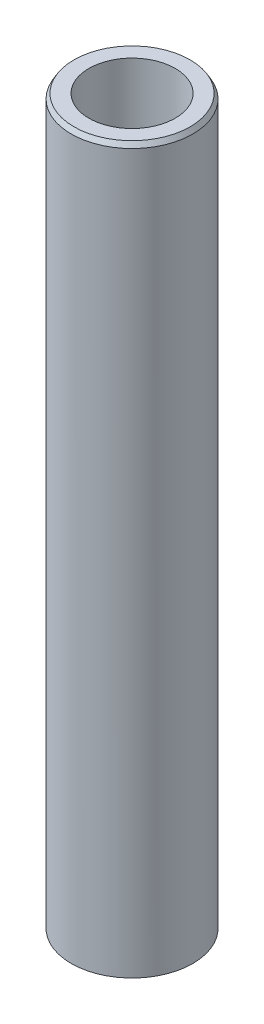
ISO-10303-21;
HEADER;
FILE_DESCRIPTION(('STEP AP214'),'2;1');
FILE_NAME('part.step','',(''),(''),'','','');
FILE_SCHEMA(('AUTOMOTIVE_DESIGN { 1 0 10303 214 1 1 1 1 }'));
ENDSEC;
DATA;
#1=APPLICATION_CONTEXT('core data for automotive mechanical design processes');
#2=APPLICATION_PROTOCOL_DEFINITION('international standard','automotive_design',2000,#1);
#3=PRODUCT_CONTEXT('',#1,'mechanical');
#4=PRODUCT('Part','Part','',(#3));
#5=PRODUCT_RELATED_PRODUCT_CATEGORY('part','',(#4));
#6=PRODUCT_DEFINITION_FORMATION('','',#4);
#7=PRODUCT_DEFINITION_CONTEXT('part definition',#1,'design');
#8=PRODUCT_DEFINITION('design','',#6,#7);
#9=PRODUCT_DEFINITION_SHAPE('','',#8);
#10=(LENGTH_UNIT() NAMED_UNIT(*) SI_UNIT(.MILLI.,.METRE.));
#11=(NAMED_UNIT(*) PLANE_ANGLE_UNIT() SI_UNIT($,.RADIAN.));
#12=(NAMED_UNIT(*) SI_UNIT($,.STERADIAN.) SOLID_ANGLE_UNIT());
#13=UNCERTAINTY_MEASURE_WITH_UNIT(LENGTH_MEASURE(1.E-05),#10,'distance_accuracy_value','');
#14=(GEOMETRIC_REPRESENTATION_CONTEXT(3) GLOBAL_UNCERTAINTY_ASSIGNED_CONTEXT((#13)) GLOBAL_UNIT_ASSIGNED_CONTEXT((#10,
#11,#12)) REPRESENTATION_CONTEXT('',''));
#15=CARTESIAN_POINT('',(0.,0.,0.));
#16=DIRECTION('',(0.,0.,1.));
#17=DIRECTION('',(1.,0.,0.));
#18=AXIS2_PLACEMENT_3D('',#15,#16,#17);
#19=CARTESIAN_POINT('',(0.,477.313091450033,0.));
#20=DIRECTION('',(0.,-1.,0.));
#21=DIRECTION('',(0.,0.,-1.));
#22=AXIS2_PLACEMENT_3D('',#19,#20,#21);
#23=CYLINDRICAL_SURFACE('',#22,40.);
#24=CARTESIAN_POINT('',(0.,474.139683479003,0.));
#25=DIRECTION('',(0.,1.,0.));
#26=DIRECTION('',(0.,0.,1.));
#27=AXIS2_PLACEMENT_3D('',#24,#25,#26);
#28=CIRCLE('',#27,40.);
#29=CARTESIAN_POINT('',(0.,474.139683479003,-40.));
#30=VERTEX_POINT('',#29);
#31=EDGE_CURVE('E50',#30,#30,#28,.F.);
#32=CARTESIAN_POINT('',(0.,1.83216794632313,0.));
#33=DIRECTION('',(0.,1.,0.));
#34=DIRECTION('',(0.,0.,1.));
#35=AXIS2_PLACEMENT_3D('',#32,#33,#34);
#36=CIRCLE('',#35,40.);
#37=CARTESIAN_POINT('',(0.,1.83216794632307,-40.));
#38=VERTEX_POINT('',#37);
#39=EDGE_CURVE('E51',#38,#38,#36,.T.);
#40=CARTESIAN_POINT('',(0.,474.139683479003,-40.));
#41=CARTESIAN_POINT('',(0.,469.219813525538,-40.));
#42=CARTESIAN_POINT('',(0.,464.299943572072,-40.));
#43=CARTESIAN_POINT('',(0.,454.460203665141,-40.));
#44=CARTESIAN_POINT('',(0.,449.540333711676,-40.));
#45=CARTESIAN_POINT('',(0.,439.700593804745,-40.));
#46=CARTESIAN_POINT('',(0.,434.78072385128,-40.));
#47=CARTESIAN_POINT('',(0.,424.940983944349,-40.));
#48=CARTESIAN_POINT('',(0.,420.021113990883,-40.));
#49=CARTESIAN_POINT('',(0.,410.181374083953,-40.));
#50=CARTESIAN_POINT('',(0.,405.261504130487,-40.));
#51=CARTESIAN_POINT('',(0.,395.421764223556,-40.));
#52=CARTESIAN_POINT('',(0.,390.501894270091,-40.));
#53=CARTESIAN_POINT('',(0.,380.66215436316,-40.));
#54=CARTESIAN_POINT('',(0.,375.742284409695,-40.));
#55=CARTESIAN_POINT('',(0.,365.902544502764,-40.));
#56=CARTESIAN_POINT('',(0.,360.982674549299,-40.));
#57=CARTESIAN_POINT('',(0.,351.142934642368,-40.));
#58=CARTESIAN_POINT('',(0.,346.223064688902,-40.));
#59=CARTESIAN_POINT('',(0.,336.383324781971,-40.));
#60=CARTESIAN_POINT('',(0.,331.463454828506,-40.));
#61=CARTESIAN_POINT('',(0.,321.623714921575,-40.));
#62=CARTESIAN_POINT('',(0.,316.70384496811,-40.));
#63=CARTESIAN_POINT('',(0.,306.864105061179,-40.));
#64=CARTESIAN_POINT('',(0.,301.944235107713,-40.));
#65=CARTESIAN_POINT('',(0.,292.104495200783,-40.));
#66=CARTESIAN_POINT('',(0.,287.184625247317,-40.));
#67=CARTESIAN_POINT('',(0.,277.344885340386,-40.));
#68=CARTESIAN_POINT('',(0.,272.425015386921,-40.));
#69=CARTESIAN_POINT('',(0.,262.58527547999,-40.));
#70=CARTESIAN_POINT('',(0.,257.665405526525,-40.));
#71=CARTESIAN_POINT('',(0.,247.825665619594,-40.));
#72=CARTESIAN_POINT('',(0.,242.905795666128,-40.));
#73=CARTESIAN_POINT('',(0.,233.066055759198,-40.));
#74=CARTESIAN_POINT('',(0.,228.146185805732,-40.));
#75=CARTESIAN_POINT('',(0.,218.306445898801,-40.));
#76=CARTESIAN_POINT('',(0.,213.386575945336,-40.));
#77=CARTESIAN_POINT('',(0.,203.546836038405,-40.));
#78=CARTESIAN_POINT('',(0.,198.62696608494,-40.));
#79=CARTESIAN_POINT('',(0.,188.787226178009,-40.));
#80=CARTESIAN_POINT('',(0.,183.867356224543,-40.));
#81=CARTESIAN_POINT('',(0.,174.027616317613,-40.));
#82=CARTESIAN_POINT('',(0.,169.107746364147,-40.));
#83=CARTESIAN_POINT('',(0.,159.268006457216,-40.));
#84=CARTESIAN_POINT('',(0.,154.348136503751,-40.));
#85=CARTESIAN_POINT('',(0.,144.50839659682,-40.));
#86=CARTESIAN_POINT('',(0.,139.588526643355,-40.));
#87=CARTESIAN_POINT('',(0.,129.748786736424,-40.));
#88=CARTESIAN_POINT('',(0.,124.828916782958,-40.));
#89=CARTESIAN_POINT('',(0.,114.989176876028,-40.));
#90=CARTESIAN_POINT('',(0.,110.069306922562,-40.));
#91=CARTESIAN_POINT('',(0.,100.229567015631,-40.));
#92=CARTESIAN_POINT('',(0.,95.3096970621661,-40.));
#93=CARTESIAN_POINT('',(0.,85.4699571552352,-40.));
#94=CARTESIAN_POINT('',(0.,80.5500872017698,-40.));
#95=CARTESIAN_POINT('',(0.,70.710347294839,-40.));
#96=CARTESIAN_POINT('',(0.,65.7904773413735,-40.));
#97=CARTESIAN_POINT('',(0.,55.9507374344427,-40.));
#98=CARTESIAN_POINT('',(0.,51.0308674809773,-40.));
#99=CARTESIAN_POINT('',(0.,41.1911275740464,-40.));
#100=CARTESIAN_POINT('',(0.,36.271257620581,-40.));
#101=CARTESIAN_POINT('',(0.,26.4315177136502,-40.));
#102=CARTESIAN_POINT('',(0.,21.5116477601848,-40.));
#103=CARTESIAN_POINT('',(0.,11.6719078532539,-40.));
#104=CARTESIAN_POINT('',(0.,6.75203789978848,-40.));
#105=CARTESIAN_POINT('',(0.,1.83216794632307,-40.));
#106=B_SPLINE_CURVE_WITH_KNOTS('',3,(#40,#41,#42,#43,#44,#45,#46,#47,#48,#49,#50,#51,#52,#53,
#54,#55,#56,#57,#58,#59,#60,#61,#62,#63,#64,#65,#66,#67,#68,#69,#70,#71,#72,#73,#74,#75,#76,#77,
#78,#79,#80,#81,#82,#83,#84,#85,#86,#87,#88,#89,#90,#91,#92,#93,#94,#95,#96,#97,#98,#99,#100,
#101,#102,#103,#104,#105),.UNSPECIFIED.,.F.,.F.,(4,2,2,2,2,2,2,2,2,2,2,2,2,2,2,2,2,2,2,2,2,2,2,
2,2,2,2,2,2,2,2,2,4),(0.,14.7596098603963,29.5192197207925,44.2788295811888,59.038439441585,
73.7980493019813,88.5576591623775,103.317269022774,118.07687888317,132.836488743566,
147.596098603963,162.355708464359,177.115318324755,191.874928185151,206.634538045547,
221.394147905944,236.15375776634,250.913367626736,265.672977487132,280.432587347529,
295.192197207925,309.951807068321,324.711416928718,339.471026789114,354.23063664951,
368.990246509906,383.749856370302,398.509466230699,413.269076091095,428.028685951491,
442.788295811888,457.547905672284,472.30751553268),.UNSPECIFIED.);
#107=EDGE_CURVE('BSEAM39',#30,#38,#106,.T.);
#108=ORIENTED_EDGE('',*,*,#31,.T.);
#109=ORIENTED_EDGE('',*,*,#39,.T.);
#110=ORIENTED_EDGE('',*,*,#107,.T.);
#111=ORIENTED_EDGE('',*,*,#107,.F.);
#112=EDGE_LOOP('',(#108,#110,#109,#111));
#113=FACE_BOUND('',#112,.T.);
#114=ADVANCED_FACE('F39',(#113),#23,.T.);
#115=CARTESIAN_POINT('',(0.,477.313091450033,0.));
#116=DIRECTION('',(0.,1.,0.));
#117=DIRECTION('',(0.,0.,1.));
#118=AXIS2_PLACEMENT_3D('',#115,#116,#117);
#119=PLANE('',#118);
#120=CARTESIAN_POINT('',(0.,477.313091450033,0.));
#121=DIRECTION('',(0.,1.,0.));
#122=DIRECTION('',(0.,0.,1.));
#123=AXIS2_PLACEMENT_3D('',#120,#121,#122);
#124=CIRCLE('',#123,38.1678320536773);
#125=CARTESIAN_POINT('',(0.,477.313091450033,38.1678320536773));
#126=VERTEX_POINT('',#125);
#127=EDGE_CURVE('E54',#126,#126,#124,.T.);
#128=ORIENTED_EDGE('',*,*,#127,.T.);
#129=EDGE_LOOP('',(#128));
#130=FACE_BOUND('',#129,.T.);
#131=CARTESIAN_POINT('',(0.,477.313091450033,0.));
#132=DIRECTION('',(0.,1.,0.));
#133=DIRECTION('',(0.,0.,1.));
#134=AXIS2_PLACEMENT_3D('',#131,#132,#133);
#135=CIRCLE('',#134,28.3904335979035);
#136=CARTESIAN_POINT('',(0.,477.313091450033,-28.3904335979035));
#137=VERTEX_POINT('',#136);
#138=EDGE_CURVE('E58',#137,#137,#135,.T.);
#139=ORIENTED_EDGE('',*,*,#138,.F.);
#140=EDGE_LOOP('',(#139));
#141=FACE_BOUND('',#140,.T.);
#142=ADVANCED_FACE('F69',(#130,#141),#119,.T.);
#143=CARTESIAN_POINT('',(0.,0.,0.));
#144=DIRECTION('',(0.,1.,0.));
#145=DIRECTION('',(0.,0.,1.));
#146=AXIS2_PLACEMENT_3D('',#143,#144,#145);
#147=PLANE('',#146);
#148=CARTESIAN_POINT('',(0.,0.,0.));
#149=DIRECTION('',(0.,1.,0.));
#150=DIRECTION('',(0.,0.,1.));
#151=AXIS2_PLACEMENT_3D('',#148,#149,#150);
#152=CIRCLE('',#151,36.8265920289692);
#153=CARTESIAN_POINT('',(0.,0.,36.8265920289692));
#154=VERTEX_POINT('',#153);
#155=EDGE_CURVE('E10',#154,#154,#152,.F.);
#156=ORIENTED_EDGE('',*,*,#155,.T.);
#157=EDGE_LOOP('',(#156));
#158=FACE_BOUND('',#157,.T.);
#159=CARTESIAN_POINT('',(0.,0.,0.));
#160=DIRECTION('',(0.,1.,0.));
#161=DIRECTION('',(0.,0.,1.));
#162=AXIS2_PLACEMENT_3D('',#159,#160,#161);
#163=CIRCLE('',#162,28.3904335979035);
#164=CARTESIAN_POINT('',(0.,0.,-28.3904335979035));
#165=VERTEX_POINT('',#164);
#166=EDGE_CURVE('E63',#165,#165,#163,.T.);
#167=ORIENTED_EDGE('',*,*,#166,.T.);
#168=EDGE_LOOP('',(#167));
#169=FACE_BOUND('',#168,.T.);
#170=ADVANCED_FACE('F75',(#158,#169),#147,.F.);
#171=CARTESIAN_POINT('',(0.,477.313091450033,0.));
#172=DIRECTION('',(0.,-1.,0.));
#173=DIRECTION('',(0.,0.,-1.));
#174=AXIS2_PLACEMENT_3D('',#171,#172,#173);
#175=CYLINDRICAL_SURFACE('',#174,28.3904335979035);
#176=CARTESIAN_POINT('',(0.,477.313091450033,-28.3904335979035));
#177=CARTESIAN_POINT('',(0.,472.341080080762,-28.3904335979035));
#178=CARTESIAN_POINT('',(0.,467.369068711491,-28.3904335979035));
#179=CARTESIAN_POINT('',(0.,457.425045972948,-28.3904335979035));
#180=CARTESIAN_POINT('',(0.,452.453034603677,-28.3904335979035));
#181=CARTESIAN_POINT('',(0.,442.509011865135,-28.3904335979035));
#182=CARTESIAN_POINT('',(0.,437.537000495864,-28.3904335979035));
#183=CARTESIAN_POINT('',(0.,427.592977757321,-28.3904335979035));
#184=CARTESIAN_POINT('',(0.,422.62096638805,-28.3904335979035));
#185=CARTESIAN_POINT('',(0.,412.676943649508,-28.3904335979035));
#186=CARTESIAN_POINT('',(0.,407.704932280237,-28.3904335979035));
#187=CARTESIAN_POINT('',(0.,397.760909541694,-28.3904335979035));
#188=CARTESIAN_POINT('',(0.,392.788898172423,-28.3904335979035));
#189=CARTESIAN_POINT('',(0.,382.844875433881,-28.3904335979035));
#190=CARTESIAN_POINT('',(0.,377.872864064609,-28.3904335979035));
#191=CARTESIAN_POINT('',(0.,367.928841326067,-28.3904335979035));
#192=CARTESIAN_POINT('',(0.,362.956829956796,-28.3904335979035));
#193=CARTESIAN_POINT('',(0.,353.012807218254,-28.3904335979035));
#194=CARTESIAN_POINT('',(0.,348.040795848982,-28.3904335979035));
#195=CARTESIAN_POINT('',(0.,338.09677311044,-28.3904335979035));
#196=CARTESIAN_POINT('',(0.,333.124761741169,-28.3904335979035));
#197=CARTESIAN_POINT('',(0.,323.180739002627,-28.3904335979035));
#198=CARTESIAN_POINT('',(0.,318.208727633355,-28.3904335979035));
#199=CARTESIAN_POINT('',(0.,308.264704894813,-28.3904335979035));
#200=CARTESIAN_POINT('',(0.,303.292693525542,-28.3904335979035));
#201=CARTESIAN_POINT('',(0.,293.348670786999,-28.3904335979035));
#202=CARTESIAN_POINT('',(0.,288.376659417728,-28.3904335979035));
#203=CARTESIAN_POINT('',(0.,278.432636679186,-28.3904335979035));
#204=CARTESIAN_POINT('',(0.,273.460625309915,-28.3904335979035));
#205=CARTESIAN_POINT('',(0.,263.516602571372,-28.3904335979035));
#206=CARTESIAN_POINT('',(0.,258.544591202101,-28.3904335979035));
#207=CARTESIAN_POINT('',(0.,248.600568463559,-28.3904335979035));
#208=CARTESIAN_POINT('',(0.,243.628557094288,-28.3904335979035));
#209=CARTESIAN_POINT('',(0.,233.684534355745,-28.3904335979035));
#210=CARTESIAN_POINT('',(0.,228.712522986474,-28.3904335979035));
#211=CARTESIAN_POINT('',(0.,218.768500247932,-28.3904335979035));
#212=CARTESIAN_POINT('',(0.,213.796488878661,-28.3904335979035));
#213=CARTESIAN_POINT('',(0.,203.852466140118,-28.3904335979035));
#214=CARTESIAN_POINT('',(0.,198.880454770847,-28.3904335979035));
#215=CARTESIAN_POINT('',(0.,188.936432032305,-28.3904335979035));
#216=CARTESIAN_POINT('',(0.,183.964420663034,-28.3904335979035));
#217=CARTESIAN_POINT('',(0.,174.020397924491,-28.3904335979035));
#218=CARTESIAN_POINT('',(0.,169.04838655522,-28.3904335979035));
#219=CARTESIAN_POINT('',(0.,159.104363816678,-28.3904335979035));
#220=CARTESIAN_POINT('',(0.,154.132352447407,-28.3904335979035));
#221=CARTESIAN_POINT('',(0.,144.188329708864,-28.3904335979035));
#222=CARTESIAN_POINT('',(0.,139.216318339593,-28.3904335979035));
#223=CARTESIAN_POINT('',(0.,129.272295601051,-28.3904335979035));
#224=CARTESIAN_POINT('',(0.,124.300284231779,-28.3904335979035));
#225=CARTESIAN_POINT('',(0.,114.356261493237,-28.3904335979035));
#226=CARTESIAN_POINT('',(0.,109.384250123966,-28.3904335979035));
#227=CARTESIAN_POINT('',(0.,99.4402273854235,-28.3904335979035));
#228=CARTESIAN_POINT('',(0.,94.4682160161524,-28.3904335979035));
#229=CARTESIAN_POINT('',(0.,84.52419327761,-28.3904335979035));
#230=CARTESIAN_POINT('',(0.,79.5521819083388,-28.3904335979035));
#231=CARTESIAN_POINT('',(0.,69.6081591697964,-28.3904335979035));
#232=CARTESIAN_POINT('',(0.,64.6361478005253,-28.3904335979035));
#233=CARTESIAN_POINT('',(0.,54.6921250619829,-28.3904335979035));
#234=CARTESIAN_POINT('',(0.,49.7201136927117,-28.3904335979035));
#235=CARTESIAN_POINT('',(0.,39.7760909541694,-28.3904335979035));
#236=CARTESIAN_POINT('',(0.,34.8040795848982,-28.3904335979035));
#237=CARTESIAN_POINT('',(0.,24.8600568463558,-28.3904335979035));
#238=CARTESIAN_POINT('',(0.,19.8880454770847,-28.3904335979035));
#239=CARTESIAN_POINT('',(0.,9.94402273854232,-28.3904335979035));
#240=CARTESIAN_POINT('',(0.,4.97201136927113,-28.3904335979035));
#241=CARTESIAN_POINT('',(0.,0.,-28.3904335979035));
#242=B_SPLINE_CURVE_WITH_KNOTS('',3,(#176,#177,#178,#179,#180,#181,#182,#183,#184,#185,#186,
#187,#188,#189,#190,#191,#192,#193,#194,#195,#196,#197,#198,#199,#200,#201,#202,#203,#204,#205,
#206,#207,#208,#209,#210,#211,#212,#213,#214,#215,#216,#217,#218,#219,#220,#221,#222,#223,#224,
#225,#226,#227,#228,#229,#230,#231,#232,#233,#234,#235,#236,#237,#238,#239,#240,#241),
.UNSPECIFIED.,.F.,.F.,(4,2,2,2,2,2,2,2,2,2,2,2,2,2,2,2,2,2,2,2,2,2,2,2,2,2,2,2,2,2,2,2,4),(0.,
14.9160341078136,29.8320682156271,44.7481023234406,59.6641364312542,74.5801705390677,
89.4962046468812,104.412238754695,119.328272862508,134.244306970322,149.160341078135,
164.076375185949,178.992409293762,193.908443401576,208.82447750939,223.740511617203,
238.656545725017,253.57257983283,268.488613940644,283.404648048457,298.320682156271,
313.236716264084,328.152750371898,343.068784479711,357.984818587525,372.900852695338,
387.816886803152,402.732920910965,417.648955018779,432.564989126593,447.481023234406,
462.39705734222,477.313091450033),.UNSPECIFIED.);
#243=EDGE_CURVE('BSEAM70',#137,#165,#242,.T.);
#244=ORIENTED_EDGE('',*,*,#138,.T.);
#245=ORIENTED_EDGE('',*,*,#166,.F.);
#246=ORIENTED_EDGE('',*,*,#243,.T.);
#247=ORIENTED_EDGE('',*,*,#243,.F.);
#248=EDGE_LOOP('',(#244,#246,#245,#247));
#249=FACE_BOUND('',#248,.T.);
#250=ADVANCED_FACE('F70',(#249),#175,.F.);
#251=CARTESIAN_POINT('',(0.,477.313091450033,0.));
#252=DIRECTION('',(0.,-1.,0.));
#253=DIRECTION('',(0.,0.,-1.));
#254=AXIS2_PLACEMENT_3D('',#251,#252,#253);
#255=CONICAL_SURFACE('',#254,38.1678320536773,0.523598775598295);
#256=ORIENTED_EDGE('',*,*,#31,.F.);
#257=EDGE_LOOP('',(#256));
#258=FACE_BOUND('',#257,.T.);
#259=ORIENTED_EDGE('',*,*,#127,.F.);
#260=EDGE_LOOP('',(#259));
#261=FACE_BOUND('',#260,.T.);
#262=ADVANCED_FACE('F81',(#258,#261),#255,.T.);
#263=CARTESIAN_POINT('',(0.,1.83216794632313,0.));
#264=DIRECTION('',(0.,1.,0.));
#265=DIRECTION('',(0.,0.,1.));
#266=AXIS2_PLACEMENT_3D('',#263,#264,#265);
#267=CONICAL_SURFACE('',#266,40.,1.0471975511966);
#268=ORIENTED_EDGE('',*,*,#155,.F.);
#269=EDGE_LOOP('',(#268));
#270=FACE_BOUND('',#269,.T.);
#271=ORIENTED_EDGE('',*,*,#39,.F.);
#272=EDGE_LOOP('',(#271));
#273=FACE_BOUND('',#272,.T.);
#274=ADVANCED_FACE('F45',(#270,#273),#267,.T.);
#275=CLOSED_SHELL('',(#114,#142,#170,#250,#262,#274));
#276=MANIFOLD_SOLID_BREP('B2',#275);
#277=ADVANCED_BREP_SHAPE_REPRESENTATION('',(#18,#276),#14);
#278=SHAPE_DEFINITION_REPRESENTATION(#9,#277);
ENDSEC;
END-ISO-10303-21;
